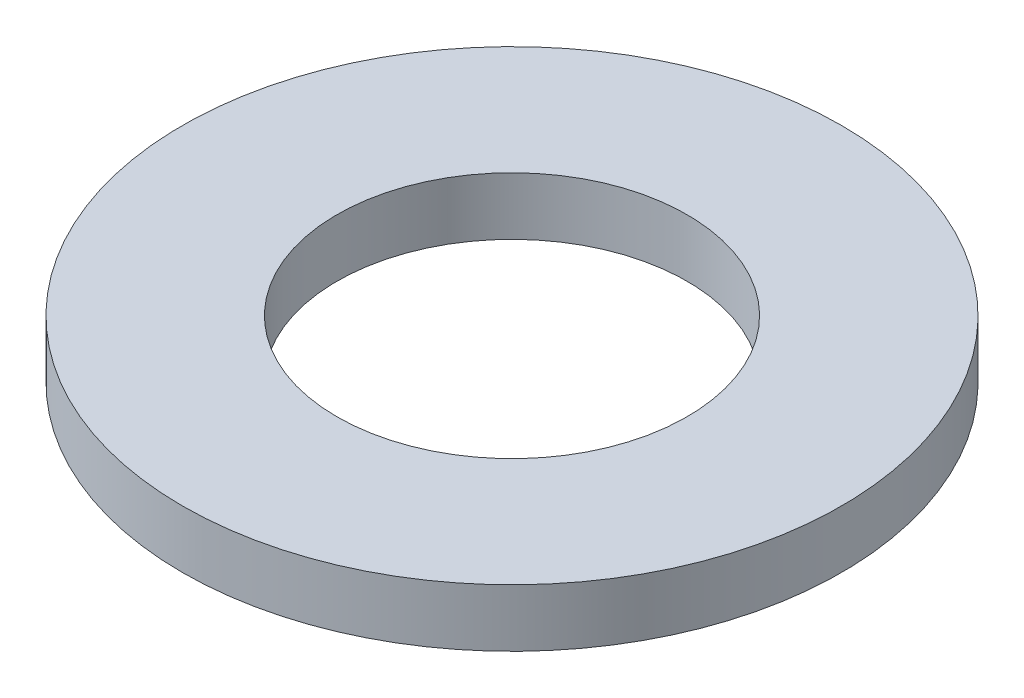
ISO-10303-21;
HEADER;
FILE_DESCRIPTION(('STEP AP214'),'2;1');
FILE_NAME('part.step','',(''),(''),'','','');
FILE_SCHEMA(('AUTOMOTIVE_DESIGN { 1 0 10303 214 1 1 1 1 }'));
ENDSEC;
DATA;
#1=APPLICATION_CONTEXT('core data for automotive mechanical design processes');
#2=APPLICATION_PROTOCOL_DEFINITION('international standard','automotive_design',2000,#1);
#3=PRODUCT_CONTEXT('',#1,'mechanical');
#4=PRODUCT('Part','Part','',(#3));
#5=PRODUCT_RELATED_PRODUCT_CATEGORY('part','',(#4));
#6=PRODUCT_DEFINITION_FORMATION('','',#4);
#7=PRODUCT_DEFINITION_CONTEXT('part definition',#1,'design');
#8=PRODUCT_DEFINITION('design','',#6,#7);
#9=PRODUCT_DEFINITION_SHAPE('','',#8);
#10=(LENGTH_UNIT() NAMED_UNIT(*) SI_UNIT(.MILLI.,.METRE.));
#11=(NAMED_UNIT(*) PLANE_ANGLE_UNIT() SI_UNIT($,.RADIAN.));
#12=(NAMED_UNIT(*) SI_UNIT($,.STERADIAN.) SOLID_ANGLE_UNIT());
#13=UNCERTAINTY_MEASURE_WITH_UNIT(LENGTH_MEASURE(1.E-05),#10,'distance_accuracy_value','');
#14=(GEOMETRIC_REPRESENTATION_CONTEXT(3) GLOBAL_UNCERTAINTY_ASSIGNED_CONTEXT((#13)) GLOBAL_UNIT_ASSIGNED_CONTEXT((#10,
#11,#12)) REPRESENTATION_CONTEXT('',''));
#15=CARTESIAN_POINT('',(0.,0.,0.));
#16=DIRECTION('',(0.,0.,1.));
#17=DIRECTION('',(1.,0.,0.));
#18=AXIS2_PLACEMENT_3D('',#15,#16,#17);
#19=CARTESIAN_POINT('',(0.,14.,0.));
#20=DIRECTION('',(0.,-1.,0.));
#21=DIRECTION('',(0.,0.,-1.));
#22=AXIS2_PLACEMENT_3D('',#19,#20,#21);
#23=CYLINDRICAL_SURFACE('',#22,80.);
#24=CARTESIAN_POINT('',(0.,14.,0.));
#25=DIRECTION('',(0.,1.,0.));
#26=DIRECTION('',(0.,0.,1.));
#27=AXIS2_PLACEMENT_3D('',#24,#25,#26);
#28=CIRCLE('',#27,80.);
#29=CARTESIAN_POINT('',(0.,14.,80.));
#30=VERTEX_POINT('',#29);
#31=EDGE_CURVE('E10',#30,#30,#28,.T.);
#32=ORIENTED_EDGE('',*,*,#31,.F.);
#33=EDGE_LOOP('',(#32));
#34=FACE_BOUND('',#33,.T.);
#35=CARTESIAN_POINT('',(0.,0.,0.));
#36=DIRECTION('',(0.,1.,0.));
#37=DIRECTION('',(0.,0.,1.));
#38=AXIS2_PLACEMENT_3D('',#35,#36,#37);
#39=CIRCLE('',#38,80.);
#40=CARTESIAN_POINT('',(0.,0.,80.));
#41=VERTEX_POINT('',#40);
#42=EDGE_CURVE('E37',#41,#41,#39,.T.);
#43=ORIENTED_EDGE('',*,*,#42,.T.);
#44=EDGE_LOOP('',(#43));
#45=FACE_BOUND('',#44,.T.);
#46=ADVANCED_FACE('F40',(#34,#45),#23,.T.);
#47=CARTESIAN_POINT('',(0.,14.,0.));
#48=DIRECTION('',(0.,1.,0.));
#49=DIRECTION('',(0.,0.,1.));
#50=AXIS2_PLACEMENT_3D('',#47,#48,#49);
#51=PLANE('',#50);
#52=CARTESIAN_POINT('',(0.,14.,0.));
#53=DIRECTION('',(0.,1.,0.));
#54=DIRECTION('',(0.,0.,1.));
#55=AXIS2_PLACEMENT_3D('',#52,#53,#54);
#56=CIRCLE('',#55,42.5);
#57=CARTESIAN_POINT('',(0.,14.,42.5));
#58=VERTEX_POINT('',#57);
#59=EDGE_CURVE('E50',#58,#58,#56,.T.);
#60=ORIENTED_EDGE('',*,*,#59,.F.);
#61=EDGE_LOOP('',(#60));
#62=FACE_BOUND('',#61,.T.);
#63=ORIENTED_EDGE('',*,*,#31,.T.);
#64=EDGE_LOOP('',(#63));
#65=FACE_BOUND('',#64,.T.);
#66=ADVANCED_FACE('F59',(#62,#65),#51,.T.);
#67=CARTESIAN_POINT('',(0.,0.,0.));
#68=DIRECTION('',(0.,1.,0.));
#69=DIRECTION('',(0.,0.,1.));
#70=AXIS2_PLACEMENT_3D('',#67,#68,#69);
#71=PLANE('',#70);
#72=CARTESIAN_POINT('',(0.,0.,0.));
#73=DIRECTION('',(0.,1.,0.));
#74=DIRECTION('',(0.,0.,1.));
#75=AXIS2_PLACEMENT_3D('',#72,#73,#74);
#76=CIRCLE('',#75,42.5);
#77=CARTESIAN_POINT('',(0.,0.,42.5));
#78=VERTEX_POINT('',#77);
#79=EDGE_CURVE('E47',#78,#78,#76,.T.);
#80=ORIENTED_EDGE('',*,*,#79,.T.);
#81=EDGE_LOOP('',(#80));
#82=FACE_BOUND('',#81,.T.);
#83=ORIENTED_EDGE('',*,*,#42,.F.);
#84=EDGE_LOOP('',(#83));
#85=FACE_BOUND('',#84,.T.);
#86=ADVANCED_FACE('F58',(#82,#85),#71,.F.);
#87=CARTESIAN_POINT('',(0.,14.,0.));
#88=DIRECTION('',(0.,-1.,0.));
#89=DIRECTION('',(0.,0.,-1.));
#90=AXIS2_PLACEMENT_3D('',#87,#88,#89);
#91=CYLINDRICAL_SURFACE('',#90,42.5);
#92=ORIENTED_EDGE('',*,*,#59,.T.);
#93=EDGE_LOOP('',(#92));
#94=FACE_BOUND('',#93,.T.);
#95=ORIENTED_EDGE('',*,*,#79,.F.);
#96=EDGE_LOOP('',(#95));
#97=FACE_BOUND('',#96,.T.);
#98=ADVANCED_FACE('F54',(#94,#97),#91,.F.);
#99=CLOSED_SHELL('',(#46,#66,#86,#98));
#100=MANIFOLD_SOLID_BREP('B2',#99);
#101=ADVANCED_BREP_SHAPE_REPRESENTATION('',(#18,#100),#14);
#102=SHAPE_DEFINITION_REPRESENTATION(#9,#101);
ENDSEC;
END-ISO-10303-21;
